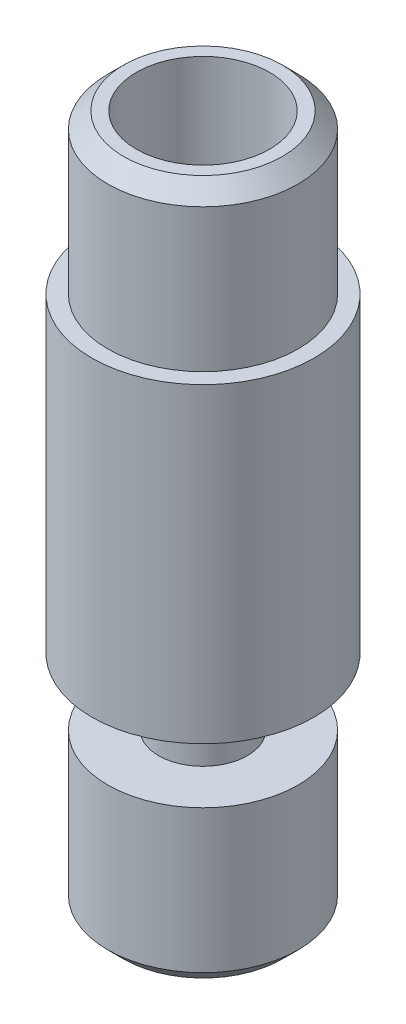
ISO-10303-21;
HEADER;
FILE_DESCRIPTION(('STEP AP214'),'2;1');
FILE_NAME('part.step','',(''),(''),'','','');
FILE_SCHEMA(('AUTOMOTIVE_DESIGN { 1 0 10303 214 1 1 1 1 }'));
ENDSEC;
DATA;
#1=APPLICATION_CONTEXT('core data for automotive mechanical design processes');
#2=APPLICATION_PROTOCOL_DEFINITION('international standard','automotive_design',2000,#1);
#3=PRODUCT_CONTEXT('',#1,'mechanical');
#4=PRODUCT('Part','Part','',(#3));
#5=PRODUCT_RELATED_PRODUCT_CATEGORY('part','',(#4));
#6=PRODUCT_DEFINITION_FORMATION('','',#4);
#7=PRODUCT_DEFINITION_CONTEXT('part definition',#1,'design');
#8=PRODUCT_DEFINITION('design','',#6,#7);
#9=PRODUCT_DEFINITION_SHAPE('','',#8);
#10=(LENGTH_UNIT() NAMED_UNIT(*) SI_UNIT(.MILLI.,.METRE.));
#11=(NAMED_UNIT(*) PLANE_ANGLE_UNIT() SI_UNIT($,.RADIAN.));
#12=(NAMED_UNIT(*) SI_UNIT($,.STERADIAN.) SOLID_ANGLE_UNIT());
#13=UNCERTAINTY_MEASURE_WITH_UNIT(LENGTH_MEASURE(1.E-05),#10,'distance_accuracy_value','');
#14=(GEOMETRIC_REPRESENTATION_CONTEXT(3) GLOBAL_UNCERTAINTY_ASSIGNED_CONTEXT((#13)) GLOBAL_UNIT_ASSIGNED_CONTEXT((#10,
#11,#12)) REPRESENTATION_CONTEXT('',''));
#15=CARTESIAN_POINT('',(0.,0.,0.));
#16=DIRECTION('',(0.,0.,1.));
#17=DIRECTION('',(1.,0.,0.));
#18=AXIS2_PLACEMENT_3D('',#15,#16,#17);
#19=CARTESIAN_POINT('',(0.,0.5,0.));
#20=DIRECTION('',(0.,1.,0.));
#21=DIRECTION('',(0.,0.,1.));
#22=AXIS2_PLACEMENT_3D('',#19,#20,#21);
#23=CYLINDRICAL_SURFACE('',#22,3.);
#24=CARTESIAN_POINT('',(0.,0.499999999999945,0.));
#25=DIRECTION('',(0.,1.,0.));
#26=DIRECTION('',(0.,0.,1.));
#27=AXIS2_PLACEMENT_3D('',#24,#25,#26);
#28=CIRCLE('',#27,3.);
#29=CARTESIAN_POINT('',(0.,0.5,3.));
#30=VERTEX_POINT('',#29);
#31=EDGE_CURVE('E31',#30,#30,#28,.T.);
#32=ORIENTED_EDGE('',*,*,#31,.T.);
#33=EDGE_LOOP('',(#32));
#34=FACE_BOUND('',#33,.T.);
#35=CARTESIAN_POINT('',(0.,5.,0.));
#36=DIRECTION('',(0.,1.,0.));
#37=DIRECTION('',(0.,0.,1.));
#38=AXIS2_PLACEMENT_3D('',#35,#36,#37);
#39=CIRCLE('',#38,3.);
#40=CARTESIAN_POINT('',(0.,5.,3.));
#41=VERTEX_POINT('',#40);
#42=EDGE_CURVE('E18',#41,#41,#39,.F.);
#43=ORIENTED_EDGE('',*,*,#42,.T.);
#44=EDGE_LOOP('',(#43));
#45=FACE_BOUND('',#44,.T.);
#46=ADVANCED_FACE('F14',(#34,#45),#23,.T.);
#47=CARTESIAN_POINT('',(-3.036,5.,3.036));
#48=DIRECTION('',(0.,-1.,0.));
#49=DIRECTION('',(0.,0.,-1.));
#50=AXIS2_PLACEMENT_3D('',#47,#48,#49);
#51=PLANE('',#50);
#52=CARTESIAN_POINT('',(0.,5.,0.));
#53=DIRECTION('',(0.,1.,0.));
#54=DIRECTION('',(-1.,0.,0.));
#55=AXIS2_PLACEMENT_3D('',#52,#53,#54);
#56=CIRCLE('',#55,1.4);
#57=CARTESIAN_POINT('',(-1.4,5.,0.));
#58=VERTEX_POINT('',#57);
#59=EDGE_CURVE('E54',#58,#58,#56,.F.);
#60=ORIENTED_EDGE('',*,*,#59,.T.);
#61=EDGE_LOOP('',(#60));
#62=FACE_BOUND('',#61,.T.);
#63=ORIENTED_EDGE('',*,*,#42,.F.);
#64=EDGE_LOOP('',(#63));
#65=FACE_BOUND('',#64,.T.);
#66=ADVANCED_FACE('F65',(#62,#65),#51,.F.);
#67=CARTESIAN_POINT('',(0.,0.,0.));
#68=DIRECTION('',(0.,1.,0.));
#69=DIRECTION('',(0.,0.,1.));
#70=AXIS2_PLACEMENT_3D('',#67,#68,#69);
#71=CONICAL_SURFACE('',#70,2.5,0.785398163397448);
#72=CARTESIAN_POINT('',(0.,0.,0.));
#73=DIRECTION('',(0.,1.,0.));
#74=DIRECTION('',(0.,0.,1.));
#75=AXIS2_PLACEMENT_3D('',#72,#73,#74);
#76=CIRCLE('',#75,2.5);
#77=CARTESIAN_POINT('',(0.,0.,2.5));
#78=VERTEX_POINT('',#77);
#79=EDGE_CURVE('E52',#78,#78,#76,.T.);
#80=ORIENTED_EDGE('',*,*,#79,.T.);
#81=EDGE_LOOP('',(#80));
#82=FACE_BOUND('',#81,.T.);
#83=ORIENTED_EDGE('',*,*,#31,.F.);
#84=EDGE_LOOP('',(#83));
#85=FACE_BOUND('',#84,.T.);
#86=ADVANCED_FACE('F67',(#82,#85),#71,.T.);
#87=CARTESIAN_POINT('',(0.,5.,0.));
#88=DIRECTION('',(0.,1.,0.));
#89=DIRECTION('',(-1.,0.,0.));
#90=AXIS2_PLACEMENT_3D('',#87,#88,#89);
#91=CYLINDRICAL_SURFACE('',#90,1.4);
#92=CARTESIAN_POINT('',(0.,7.1,0.));
#93=DIRECTION('',(0.,1.,0.));
#94=DIRECTION('',(-1.,0.,0.));
#95=AXIS2_PLACEMENT_3D('',#92,#93,#94);
#96=CIRCLE('',#95,1.4);
#97=CARTESIAN_POINT('',(-1.4,7.1,0.));
#98=VERTEX_POINT('',#97);
#99=EDGE_CURVE('E49',#98,#98,#96,.F.);
#100=ORIENTED_EDGE('',*,*,#99,.T.);
#101=EDGE_LOOP('',(#100));
#102=FACE_BOUND('',#101,.T.);
#103=ORIENTED_EDGE('',*,*,#59,.F.);
#104=EDGE_LOOP('',(#103));
#105=FACE_BOUND('',#104,.T.);
#106=ADVANCED_FACE('F74',(#102,#105),#91,.T.);
#107=CARTESIAN_POINT('',(-2.53,0.,-2.53));
#108=DIRECTION('',(0.,1.,0.));
#109=DIRECTION('',(0.,0.,1.));
#110=AXIS2_PLACEMENT_3D('',#107,#108,#109);
#111=PLANE('',#110);
#112=CARTESIAN_POINT('',(0.,0.,0.));
#113=DIRECTION('',(0.,1.,0.));
#114=DIRECTION('',(0.,0.,1.));
#115=AXIS2_PLACEMENT_3D('',#112,#113,#114);
#116=CIRCLE('',#115,1.);
#117=CARTESIAN_POINT('',(0.,0.,1.));
#118=VERTEX_POINT('',#117);
#119=EDGE_CURVE('E46',#118,#118,#116,.F.);
#120=ORIENTED_EDGE('',*,*,#119,.F.);
#121=EDGE_LOOP('',(#120));
#122=FACE_BOUND('',#121,.T.);
#123=ORIENTED_EDGE('',*,*,#79,.F.);
#124=EDGE_LOOP('',(#123));
#125=FACE_BOUND('',#124,.T.);
#126=ADVANCED_FACE('F112',(#122,#125),#111,.F.);
#127=CARTESIAN_POINT('',(-3.542,7.1,-3.542));
#128=DIRECTION('',(0.,1.,0.));
#129=DIRECTION('',(0.,0.,1.));
#130=AXIS2_PLACEMENT_3D('',#127,#128,#129);
#131=PLANE('',#130);
#132=ORIENTED_EDGE('',*,*,#99,.F.);
#133=EDGE_LOOP('',(#132));
#134=FACE_BOUND('',#133,.T.);
#135=CARTESIAN_POINT('',(0.,7.1,0.));
#136=DIRECTION('',(0.,1.,0.));
#137=DIRECTION('',(-1.,0.,0.));
#138=AXIS2_PLACEMENT_3D('',#135,#136,#137);
#139=CIRCLE('',#138,3.5);
#140=CARTESIAN_POINT('',(-3.5,7.1,0.));
#141=VERTEX_POINT('',#140);
#142=EDGE_CURVE('E43',#141,#141,#139,.F.);
#143=ORIENTED_EDGE('',*,*,#142,.T.);
#144=EDGE_LOOP('',(#143));
#145=FACE_BOUND('',#144,.T.);
#146=ADVANCED_FACE('F109',(#134,#145),#131,.F.);
#147=CARTESIAN_POINT('',(0.,0.,0.));
#148=DIRECTION('',(0.,1.,0.));
#149=DIRECTION('',(0.,0.,1.));
#150=AXIS2_PLACEMENT_3D('',#147,#148,#149);
#151=CYLINDRICAL_SURFACE('',#150,1.);
#152=ORIENTED_EDGE('',*,*,#119,.T.);
#153=EDGE_LOOP('',(#152));
#154=FACE_BOUND('',#153,.T.);
#155=CARTESIAN_POINT('',(0.,15.8,0.));
#156=DIRECTION('',(0.,1.,0.));
#157=DIRECTION('',(0.,0.,1.));
#158=AXIS2_PLACEMENT_3D('',#155,#156,#157);
#159=CIRCLE('',#158,1.);
#160=CARTESIAN_POINT('',(0.,15.8,1.));
#161=VERTEX_POINT('',#160);
#162=EDGE_CURVE('E42',#161,#161,#159,.F.);
#163=ORIENTED_EDGE('',*,*,#162,.F.);
#164=EDGE_LOOP('',(#163));
#165=FACE_BOUND('',#164,.T.);
#166=ADVANCED_FACE('F105',(#154,#165),#151,.F.);
#167=CARTESIAN_POINT('',(0.,7.1,0.));
#168=DIRECTION('',(0.,1.,0.));
#169=DIRECTION('',(-1.,0.,0.));
#170=AXIS2_PLACEMENT_3D('',#167,#168,#169);
#171=CYLINDRICAL_SURFACE('',#170,3.5);
#172=CARTESIAN_POINT('',(0.,16.9,0.));
#173=DIRECTION('',(0.,1.,0.));
#174=DIRECTION('',(-1.,0.,0.));
#175=AXIS2_PLACEMENT_3D('',#172,#173,#174);
#176=CIRCLE('',#175,3.5);
#177=CARTESIAN_POINT('',(-3.5,16.9,0.));
#178=VERTEX_POINT('',#177);
#179=EDGE_CURVE('E39',#178,#178,#176,.F.);
#180=ORIENTED_EDGE('',*,*,#179,.T.);
#181=EDGE_LOOP('',(#180));
#182=FACE_BOUND('',#181,.T.);
#183=ORIENTED_EDGE('',*,*,#142,.F.);
#184=EDGE_LOOP('',(#183));
#185=FACE_BOUND('',#184,.T.);
#186=ADVANCED_FACE('F101',(#182,#185),#171,.T.);
#187=CARTESIAN_POINT('',(0.,15.8,0.));
#188=DIRECTION('',(0.,1.,0.));
#189=DIRECTION('',(0.,0.,1.));
#190=AXIS2_PLACEMENT_3D('',#187,#188,#189);
#191=CONICAL_SURFACE('',#190,1.,0.78539816339745);
#192=ORIENTED_EDGE('',*,*,#162,.T.);
#193=EDGE_LOOP('',(#192));
#194=FACE_BOUND('',#193,.T.);
#195=CARTESIAN_POINT('',(0.,16.9,0.));
#196=DIRECTION('',(0.,1.,0.));
#197=DIRECTION('',(0.,0.,1.));
#198=AXIS2_PLACEMENT_3D('',#195,#196,#197);
#199=CIRCLE('',#198,2.1);
#200=CARTESIAN_POINT('',(0.,16.9,2.1));
#201=VERTEX_POINT('',#200);
#202=EDGE_CURVE('E38',#201,#201,#199,.F.);
#203=ORIENTED_EDGE('',*,*,#202,.F.);
#204=EDGE_LOOP('',(#203));
#205=FACE_BOUND('',#204,.T.);
#206=ADVANCED_FACE('F98',(#194,#205),#191,.F.);
#207=CARTESIAN_POINT('',(-3.542,16.9,3.542));
#208=DIRECTION('',(0.,-1.,0.));
#209=DIRECTION('',(0.,0.,-1.));
#210=AXIS2_PLACEMENT_3D('',#207,#208,#209);
#211=PLANE('',#210);
#212=CARTESIAN_POINT('',(0.,16.9,0.));
#213=DIRECTION('',(0.,1.,0.));
#214=DIRECTION('',(0.,0.,1.));
#215=AXIS2_PLACEMENT_3D('',#212,#213,#214);
#216=CIRCLE('',#215,3.);
#217=CARTESIAN_POINT('',(0.,16.9,3.));
#218=VERTEX_POINT('',#217);
#219=EDGE_CURVE('E35',#218,#218,#216,.F.);
#220=ORIENTED_EDGE('',*,*,#219,.T.);
#221=EDGE_LOOP('',(#220));
#222=FACE_BOUND('',#221,.T.);
#223=ORIENTED_EDGE('',*,*,#179,.F.);
#224=EDGE_LOOP('',(#223));
#225=FACE_BOUND('',#224,.T.);
#226=ADVANCED_FACE('F96',(#222,#225),#211,.F.);
#227=CARTESIAN_POINT('',(0.,16.9,0.));
#228=DIRECTION('',(0.,1.,0.));
#229=DIRECTION('',(0.,0.,1.));
#230=AXIS2_PLACEMENT_3D('',#227,#228,#229);
#231=CYLINDRICAL_SURFACE('',#230,2.1);
#232=ORIENTED_EDGE('',*,*,#202,.T.);
#233=EDGE_LOOP('',(#232));
#234=FACE_BOUND('',#233,.T.);
#235=CARTESIAN_POINT('',(0.,21.9,0.));
#236=DIRECTION('',(0.,1.,0.));
#237=DIRECTION('',(0.,0.,1.));
#238=AXIS2_PLACEMENT_3D('',#235,#236,#237);
#239=CIRCLE('',#238,2.1);
#240=CARTESIAN_POINT('',(0.,21.9,2.1));
#241=VERTEX_POINT('',#240);
#242=EDGE_CURVE('E27',#241,#241,#239,.T.);
#243=ORIENTED_EDGE('',*,*,#242,.T.);
#244=EDGE_LOOP('',(#243));
#245=FACE_BOUND('',#244,.T.);
#246=ADVANCED_FACE('F92',(#234,#245),#231,.F.);
#247=CARTESIAN_POINT('',(0.,16.9,0.));
#248=DIRECTION('',(0.,1.,0.));
#249=DIRECTION('',(0.,0.,1.));
#250=AXIS2_PLACEMENT_3D('',#247,#248,#249);
#251=CYLINDRICAL_SURFACE('',#250,3.);
#252=CARTESIAN_POINT('',(0.,21.4000000000001,0.));
#253=DIRECTION('',(0.,-1.,0.));
#254=DIRECTION('',(0.,0.,-1.));
#255=AXIS2_PLACEMENT_3D('',#252,#253,#254);
#256=CIRCLE('',#255,3.);
#257=CARTESIAN_POINT('',(0.,21.4,-3.));
#258=VERTEX_POINT('',#257);
#259=EDGE_CURVE('E22',#258,#258,#256,.T.);
#260=ORIENTED_EDGE('',*,*,#259,.T.);
#261=EDGE_LOOP('',(#260));
#262=FACE_BOUND('',#261,.T.);
#263=ORIENTED_EDGE('',*,*,#219,.F.);
#264=EDGE_LOOP('',(#263));
#265=FACE_BOUND('',#264,.T.);
#266=ADVANCED_FACE('F86',(#262,#265),#251,.T.);
#267=CARTESIAN_POINT('',(-2.53,21.9,2.53));
#268=DIRECTION('',(0.,-1.,0.));
#269=DIRECTION('',(0.,0.,-1.));
#270=AXIS2_PLACEMENT_3D('',#267,#268,#269);
#271=PLANE('',#270);
#272=ORIENTED_EDGE('',*,*,#242,.F.);
#273=EDGE_LOOP('',(#272));
#274=FACE_BOUND('',#273,.T.);
#275=CARTESIAN_POINT('',(0.,21.9,0.));
#276=DIRECTION('',(0.,-1.,0.));
#277=DIRECTION('',(1.,0.,0.));
#278=AXIS2_PLACEMENT_3D('',#275,#276,#277);
#279=CIRCLE('',#278,2.49999999999997);
#280=CARTESIAN_POINT('',(2.49999999999997,21.9,0.));
#281=VERTEX_POINT('',#280);
#282=EDGE_CURVE('E10',#281,#281,#279,.F.);
#283=ORIENTED_EDGE('',*,*,#282,.T.);
#284=EDGE_LOOP('',(#283));
#285=FACE_BOUND('',#284,.T.);
#286=ADVANCED_FACE('F16',(#274,#285),#271,.F.);
#287=CARTESIAN_POINT('',(0.,21.9,0.));
#288=DIRECTION('',(0.,-1.,0.));
#289=DIRECTION('',(1.,0.,0.));
#290=AXIS2_PLACEMENT_3D('',#287,#288,#289);
#291=CONICAL_SURFACE('',#290,2.5,0.785398163397448);
#292=ORIENTED_EDGE('',*,*,#282,.F.);
#293=EDGE_LOOP('',(#292));
#294=FACE_BOUND('',#293,.T.);
#295=ORIENTED_EDGE('',*,*,#259,.F.);
#296=EDGE_LOOP('',(#295));
#297=FACE_BOUND('',#296,.T.);
#298=ADVANCED_FACE('F79',(#294,#297),#291,.T.);
#299=CLOSED_SHELL('',(#46,#66,#86,#106,#126,#146,#166,#186,#206,#226,#246,#266,#286,#298));
#300=MANIFOLD_SOLID_BREP('B1',#299);
#301=ADVANCED_BREP_SHAPE_REPRESENTATION('',(#18,#300),#14);
#302=SHAPE_DEFINITION_REPRESENTATION(#9,#301);
ENDSEC;
END-ISO-10303-21;
